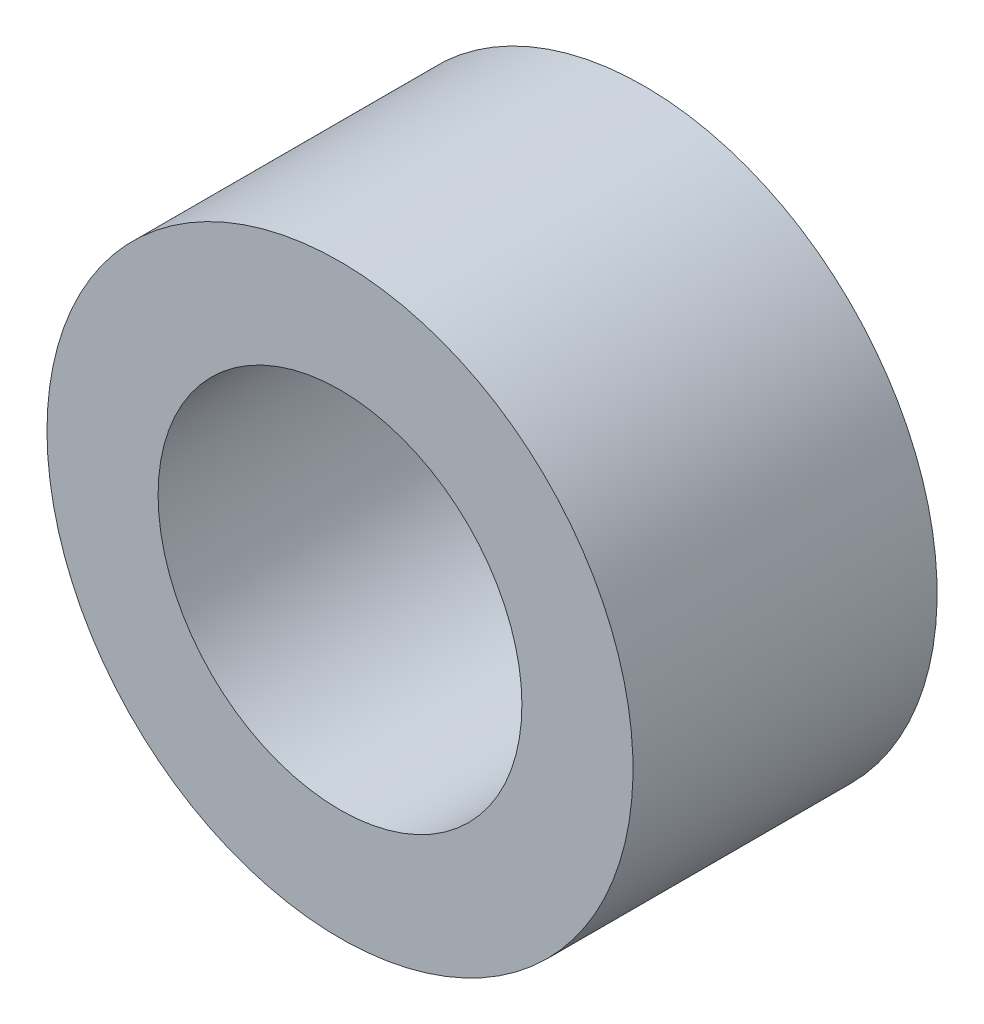
ISO-10303-21;
HEADER;
FILE_DESCRIPTION(('STEP AP214'),'2;1');
FILE_NAME('part.step','',(''),(''),'','','');
FILE_SCHEMA(('AUTOMOTIVE_DESIGN { 1 0 10303 214 1 1 1 1 }'));
ENDSEC;
DATA;
#1=APPLICATION_CONTEXT('core data for automotive mechanical design processes');
#2=APPLICATION_PROTOCOL_DEFINITION('international standard','automotive_design',2000,#1);
#3=PRODUCT_CONTEXT('',#1,'mechanical');
#4=PRODUCT('Part','Part','',(#3));
#5=PRODUCT_RELATED_PRODUCT_CATEGORY('part','',(#4));
#6=PRODUCT_DEFINITION_FORMATION('','',#4);
#7=PRODUCT_DEFINITION_CONTEXT('part definition',#1,'design');
#8=PRODUCT_DEFINITION('design','',#6,#7);
#9=PRODUCT_DEFINITION_SHAPE('','',#8);
#10=(LENGTH_UNIT() NAMED_UNIT(*) SI_UNIT(.MILLI.,.METRE.));
#11=(NAMED_UNIT(*) PLANE_ANGLE_UNIT() SI_UNIT($,.RADIAN.));
#12=(NAMED_UNIT(*) SI_UNIT($,.STERADIAN.) SOLID_ANGLE_UNIT());
#13=UNCERTAINTY_MEASURE_WITH_UNIT(LENGTH_MEASURE(1.E-05),#10,'distance_accuracy_value','');
#14=(GEOMETRIC_REPRESENTATION_CONTEXT(3) GLOBAL_UNCERTAINTY_ASSIGNED_CONTEXT((#13)) GLOBAL_UNIT_ASSIGNED_CONTEXT((#10,
#11,#12)) REPRESENTATION_CONTEXT('',''));
#15=CARTESIAN_POINT('',(0.,0.,0.));
#16=DIRECTION('',(0.,0.,1.));
#17=DIRECTION('',(1.,0.,0.));
#18=AXIS2_PLACEMENT_3D('',#15,#16,#17);
#19=CARTESIAN_POINT('',(185.751795181065,320.521396786328,0.));
#20=DIRECTION('',(0.,0.,1.));
#21=DIRECTION('',(0.,-1.,0.));
#22=AXIS2_PLACEMENT_3D('',#19,#20,#21);
#23=PLANE('',#22);
#24=CARTESIAN_POINT('',(185.751795181065,320.521396786328,0.));
#25=DIRECTION('',(0.,0.,-1.));
#26=DIRECTION('',(-0.262102548811005,0.965040027100832,0.));
#27=AXIS2_PLACEMENT_3D('',#24,#25,#26);
#28=CIRCLE('',#27,3.3274);
#29=CARTESIAN_POINT('',(186.623915201978,317.310322600153,0.));
#30=VERTEX_POINT('',#29);
#31=EDGE_CURVE('E54',#30,#30,#28,.T.);
#32=ORIENTED_EDGE('',*,*,#31,.F.);
#33=EDGE_LOOP('',(#32));
#34=FACE_BOUND('',#33,.T.);
#35=CARTESIAN_POINT('',(185.751795181065,320.521396786328,0.));
#36=DIRECTION('',(0.,0.,1.));
#37=DIRECTION('',(0.262102548811005,-0.965040027100832,0.));
#38=AXIS2_PLACEMENT_3D('',#35,#36,#37);
#39=CIRCLE('',#38,5.3594);
#40=CARTESIAN_POINT('',(184.347082780967,325.693432307573,0.));
#41=VERTEX_POINT('',#40);
#42=EDGE_CURVE('E11',#41,#41,#39,.T.);
#43=ORIENTED_EDGE('',*,*,#42,.F.);
#44=EDGE_LOOP('',(#43));
#45=FACE_BOUND('',#44,.T.);
#46=ADVANCED_FACE('F17',(#34,#45),#23,.F.);
#47=CARTESIAN_POINT('',(185.751795181065,320.521396786328,5.5626));
#48=DIRECTION('',(0.,0.,1.));
#49=DIRECTION('',(0.,-1.,0.));
#50=AXIS2_PLACEMENT_3D('',#47,#48,#49);
#51=PLANE('',#50);
#52=CARTESIAN_POINT('',(185.751795181065,320.521396786328,5.5626));
#53=DIRECTION('',(0.,0.,-1.));
#54=DIRECTION('',(-0.262102548811005,0.965040027100832,0.));
#55=AXIS2_PLACEMENT_3D('',#52,#53,#54);
#56=CIRCLE('',#55,3.3274);
#57=CARTESIAN_POINT('',(186.623915201978,317.310322600153,5.5626));
#58=VERTEX_POINT('',#57);
#59=EDGE_CURVE('E52',#58,#58,#56,.T.);
#60=ORIENTED_EDGE('',*,*,#59,.T.);
#61=EDGE_LOOP('',(#60));
#62=FACE_BOUND('',#61,.T.);
#63=CARTESIAN_POINT('',(185.751795181065,320.521396786328,5.5626));
#64=DIRECTION('',(0.,0.,1.));
#65=DIRECTION('',(0.262102548811005,-0.965040027100832,0.));
#66=AXIS2_PLACEMENT_3D('',#63,#64,#65);
#67=CIRCLE('',#66,5.3594);
#68=CARTESIAN_POINT('',(184.347082780967,325.693432307573,5.5626));
#69=VERTEX_POINT('',#68);
#70=EDGE_CURVE('E65',#69,#69,#67,.T.);
#71=ORIENTED_EDGE('',*,*,#70,.T.);
#72=EDGE_LOOP('',(#71));
#73=FACE_BOUND('',#72,.T.);
#74=ADVANCED_FACE('F19',(#62,#73),#51,.T.);
#75=CARTESIAN_POINT('',(185.751795181065,320.521396786328,0.));
#76=DIRECTION('',(0.,0.,1.));
#77=DIRECTION('',(0.262102548811005,-0.965040027100832,0.));
#78=AXIS2_PLACEMENT_3D('',#75,#76,#77);
#79=CYLINDRICAL_SURFACE('',#78,5.3594);
#80=ORIENTED_EDGE('',*,*,#70,.F.);
#81=DIRECTION('',(0.,0.,-1.));
#82=VECTOR('',#81,1.);
#83=CARTESIAN_POINT('',(184.347082780967,325.693432307573,0.));
#84=LINE('',#83,#82);
#85=EDGE_CURVE('E27',#69,#41,#84,.T.);
#86=ORIENTED_EDGE('',*,*,#85,.T.);
#87=ORIENTED_EDGE('',*,*,#42,.T.);
#88=ORIENTED_EDGE('',*,*,#85,.F.);
#89=EDGE_LOOP('',(#80,#86,#87,#88));
#90=FACE_BOUND('',#89,.T.);
#91=ADVANCED_FACE('F71',(#90),#79,.T.);
#92=CARTESIAN_POINT('',(185.751795181065,320.521396786328,0.));
#93=DIRECTION('',(0.,0.,1.));
#94=DIRECTION('',(-0.262102548811005,0.965040027100832,0.));
#95=AXIS2_PLACEMENT_3D('',#92,#93,#94);
#96=CYLINDRICAL_SURFACE('',#95,3.3274);
#97=ORIENTED_EDGE('',*,*,#59,.F.);
#98=DIRECTION('',(0.,0.,-1.));
#99=VECTOR('',#98,1.);
#100=CARTESIAN_POINT('',(186.623915201978,317.310322600153,0.));
#101=LINE('',#100,#99);
#102=EDGE_CURVE('E49',#58,#30,#101,.T.);
#103=ORIENTED_EDGE('',*,*,#102,.T.);
#104=ORIENTED_EDGE('',*,*,#31,.T.);
#105=ORIENTED_EDGE('',*,*,#102,.F.);
#106=EDGE_LOOP('',(#97,#103,#104,#105));
#107=FACE_BOUND('',#106,.T.);
#108=ADVANCED_FACE('F51',(#107),#96,.F.);
#109=CLOSED_SHELL('',(#46,#74,#91,#108));
#110=MANIFOLD_SOLID_BREP('B1',#109);
#111=ADVANCED_BREP_SHAPE_REPRESENTATION('',(#18,#110),#14);
#112=SHAPE_DEFINITION_REPRESENTATION(#9,#111);
ENDSEC;
END-ISO-10303-21;
